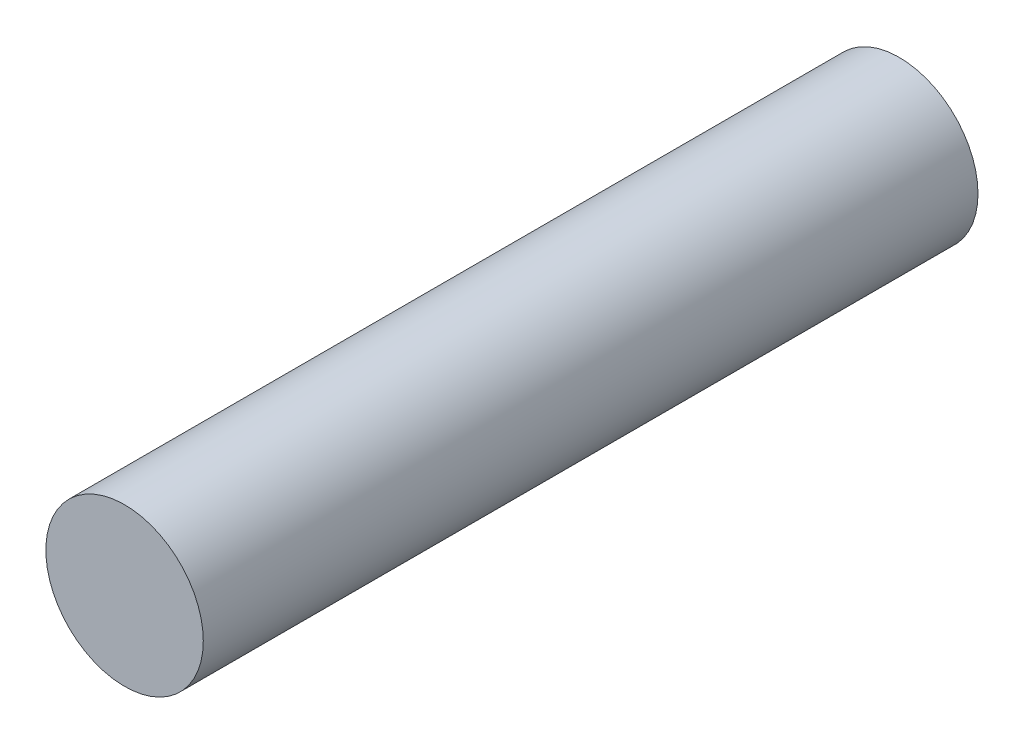
ISO-10303-21;
HEADER;
FILE_DESCRIPTION(('STEP AP214'),'2;1');
FILE_NAME('part.step','',(''),(''),'','','');
FILE_SCHEMA(('AUTOMOTIVE_DESIGN { 1 0 10303 214 1 1 1 1 }'));
ENDSEC;
DATA;
#1=APPLICATION_CONTEXT('core data for automotive mechanical design processes');
#2=APPLICATION_PROTOCOL_DEFINITION('international standard','automotive_design',2000,#1);
#3=PRODUCT_CONTEXT('',#1,'mechanical');
#4=PRODUCT('Part','Part','',(#3));
#5=PRODUCT_RELATED_PRODUCT_CATEGORY('part','',(#4));
#6=PRODUCT_DEFINITION_FORMATION('','',#4);
#7=PRODUCT_DEFINITION_CONTEXT('part definition',#1,'design');
#8=PRODUCT_DEFINITION('design','',#6,#7);
#9=PRODUCT_DEFINITION_SHAPE('','',#8);
#10=(LENGTH_UNIT() NAMED_UNIT(*) SI_UNIT(.MILLI.,.METRE.));
#11=(NAMED_UNIT(*) PLANE_ANGLE_UNIT() SI_UNIT($,.RADIAN.));
#12=(NAMED_UNIT(*) SI_UNIT($,.STERADIAN.) SOLID_ANGLE_UNIT());
#13=UNCERTAINTY_MEASURE_WITH_UNIT(LENGTH_MEASURE(1.E-05),#10,'distance_accuracy_value','');
#14=(GEOMETRIC_REPRESENTATION_CONTEXT(3) GLOBAL_UNCERTAINTY_ASSIGNED_CONTEXT((#13)) GLOBAL_UNIT_ASSIGNED_CONTEXT((#10,
#11,#12)) REPRESENTATION_CONTEXT('',''));
#15=CARTESIAN_POINT('',(0.,0.,0.));
#16=DIRECTION('',(0.,0.,1.));
#17=DIRECTION('',(1.,0.,0.));
#18=AXIS2_PLACEMENT_3D('',#15,#16,#17);
#19=CARTESIAN_POINT('',(0.,0.,78.74));
#20=DIRECTION('',(0.,0.,-1.));
#21=DIRECTION('',(-1.,0.,0.));
#22=AXIS2_PLACEMENT_3D('',#19,#20,#21);
#23=CYLINDRICAL_SURFACE('',#22,8.001);
#24=CARTESIAN_POINT('',(0.,0.,78.74));
#25=DIRECTION('',(0.,0.,1.));
#26=DIRECTION('',(1.,0.,0.));
#27=AXIS2_PLACEMENT_3D('',#24,#25,#26);
#28=CIRCLE('',#27,8.001);
#29=CARTESIAN_POINT('',(8.001,0.,78.74));
#30=VERTEX_POINT('',#29);
#31=EDGE_CURVE('E10',#30,#30,#28,.T.);
#32=ORIENTED_EDGE('',*,*,#31,.F.);
#33=EDGE_LOOP('',(#32));
#34=FACE_BOUND('',#33,.T.);
#35=CARTESIAN_POINT('',(0.,0.,0.));
#36=DIRECTION('',(0.,0.,1.));
#37=DIRECTION('',(1.,0.,0.));
#38=AXIS2_PLACEMENT_3D('',#35,#36,#37);
#39=CIRCLE('',#38,8.001);
#40=CARTESIAN_POINT('',(8.001,0.,0.));
#41=VERTEX_POINT('',#40);
#42=EDGE_CURVE('E34',#41,#41,#39,.T.);
#43=ORIENTED_EDGE('',*,*,#42,.T.);
#44=EDGE_LOOP('',(#43));
#45=FACE_BOUND('',#44,.T.);
#46=ADVANCED_FACE('F31',(#34,#45),#23,.T.);
#47=CARTESIAN_POINT('',(0.,0.,78.74));
#48=DIRECTION('',(0.,0.,1.));
#49=DIRECTION('',(1.,0.,0.));
#50=AXIS2_PLACEMENT_3D('',#47,#48,#49);
#51=PLANE('',#50);
#52=ORIENTED_EDGE('',*,*,#31,.T.);
#53=EDGE_LOOP('',(#52));
#54=FACE_BOUND('',#53,.T.);
#55=ADVANCED_FACE('F46',(#54),#51,.T.);
#56=CARTESIAN_POINT('',(0.,0.,0.));
#57=DIRECTION('',(0.,0.,1.));
#58=DIRECTION('',(1.,0.,0.));
#59=AXIS2_PLACEMENT_3D('',#56,#57,#58);
#60=PLANE('',#59);
#61=ORIENTED_EDGE('',*,*,#42,.F.);
#62=EDGE_LOOP('',(#61));
#63=FACE_BOUND('',#62,.T.);
#64=ADVANCED_FACE('F44',(#63),#60,.F.);
#65=CLOSED_SHELL('',(#46,#55,#64));
#66=MANIFOLD_SOLID_BREP('B2',#65);
#67=ADVANCED_BREP_SHAPE_REPRESENTATION('',(#18,#66),#14);
#68=SHAPE_DEFINITION_REPRESENTATION(#9,#67);
ENDSEC;
END-ISO-10303-21;
